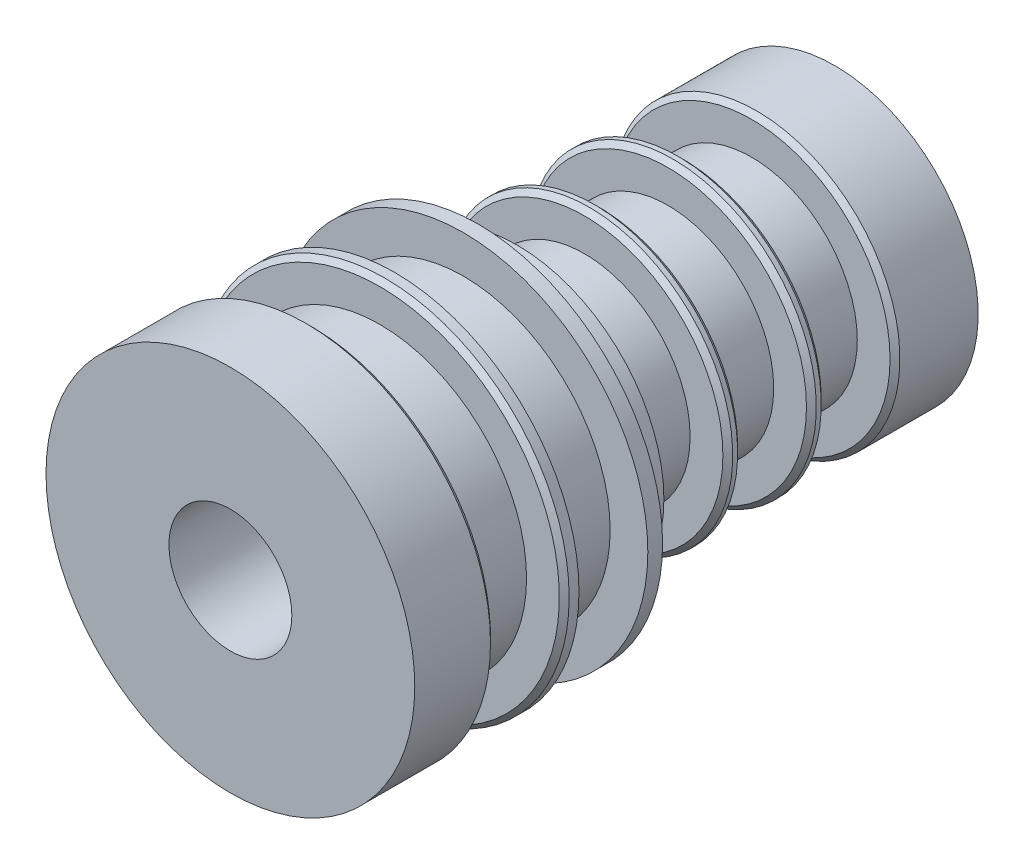
ISO-10303-21;
HEADER;
FILE_DESCRIPTION(('STEP AP214'),'2;1');
FILE_NAME('part.step','',(''),(''),'','','');
FILE_SCHEMA(('AUTOMOTIVE_DESIGN { 1 0 10303 214 1 1 1 1 }'));
ENDSEC;
DATA;
#1=APPLICATION_CONTEXT('core data for automotive mechanical design processes');
#2=APPLICATION_PROTOCOL_DEFINITION('international standard','automotive_design',2000,#1);
#3=PRODUCT_CONTEXT('',#1,'mechanical');
#4=PRODUCT('Part','Part','',(#3));
#5=PRODUCT_RELATED_PRODUCT_CATEGORY('part','',(#4));
#6=PRODUCT_DEFINITION_FORMATION('','',#4);
#7=PRODUCT_DEFINITION_CONTEXT('part definition',#1,'design');
#8=PRODUCT_DEFINITION('design','',#6,#7);
#9=PRODUCT_DEFINITION_SHAPE('','',#8);
#10=(LENGTH_UNIT() NAMED_UNIT(*) SI_UNIT(.MILLI.,.METRE.));
#11=(NAMED_UNIT(*) PLANE_ANGLE_UNIT() SI_UNIT($,.RADIAN.));
#12=(NAMED_UNIT(*) SI_UNIT($,.STERADIAN.) SOLID_ANGLE_UNIT());
#13=UNCERTAINTY_MEASURE_WITH_UNIT(LENGTH_MEASURE(1.E-05),#10,'distance_accuracy_value','');
#14=(GEOMETRIC_REPRESENTATION_CONTEXT(3) GLOBAL_UNCERTAINTY_ASSIGNED_CONTEXT((#13)) GLOBAL_UNIT_ASSIGNED_CONTEXT((#10,
#11,#12)) REPRESENTATION_CONTEXT('',''));
#15=CARTESIAN_POINT('',(0.,0.,0.));
#16=DIRECTION('',(0.,0.,1.));
#17=DIRECTION('',(1.,0.,0.));
#18=AXIS2_PLACEMENT_3D('',#15,#16,#17);
#19=CARTESIAN_POINT('',(0.,0.,-0.396875000000001));
#20=DIRECTION('',(0.,0.,1.));
#21=DIRECTION('',(1.,0.,0.));
#22=AXIS2_PLACEMENT_3D('',#19,#20,#21);
#23=CYLINDRICAL_SURFACE('',#22,14.2875);
#24=CARTESIAN_POINT('',(0.,0.,9.864725));
#25=DIRECTION('',(0.,0.,-1.));
#26=DIRECTION('',(-1.,0.,0.));
#27=AXIS2_PLACEMENT_3D('',#24,#25,#26);
#28=CIRCLE('',#27,14.2875);
#29=CARTESIAN_POINT('',(-14.2875,0.,9.864725));
#30=VERTEX_POINT('',#29);
#31=EDGE_CURVE('E62',#30,#30,#28,.T.);
#32=ORIENTED_EDGE('',*,*,#31,.T.);
#33=EDGE_LOOP('',(#32));
#34=FACE_BOUND('',#33,.T.);
#35=CARTESIAN_POINT('',(0.,0.,9.102725));
#36=DIRECTION('',(0.,0.,-1.));
#37=DIRECTION('',(-1.,0.,0.));
#38=AXIS2_PLACEMENT_3D('',#35,#36,#37);
#39=CIRCLE('',#38,14.2875);
#40=CARTESIAN_POINT('',(-14.2875,0.,9.102725));
#41=VERTEX_POINT('',#40);
#42=EDGE_CURVE('E135',#41,#41,#39,.T.);
#43=ORIENTED_EDGE('',*,*,#42,.F.);
#44=EDGE_LOOP('',(#43));
#45=FACE_BOUND('',#44,.T.);
#46=ADVANCED_FACE('F33',(#34,#45),#23,.T.);
#47=CARTESIAN_POINT('',(0.,0.,-0.396875000000001));
#48=DIRECTION('',(0.,0.,1.));
#49=DIRECTION('',(1.,0.,0.));
#50=AXIS2_PLACEMENT_3D('',#47,#48,#49);
#51=PLANE('',#50);
#52=CARTESIAN_POINT('',(0.,0.,-0.396875000000001));
#53=DIRECTION('',(0.,0.,1.));
#54=DIRECTION('',(1.,0.,0.));
#55=AXIS2_PLACEMENT_3D('',#52,#53,#54);
#56=CIRCLE('',#55,11.1125);
#57=CARTESIAN_POINT('',(11.1125,0.,-0.396875000000001));
#58=VERTEX_POINT('',#57);
#59=EDGE_CURVE('E105',#58,#58,#56,.T.);
#60=ORIENTED_EDGE('',*,*,#59,.T.);
#61=EDGE_LOOP('',(#60));
#62=FACE_BOUND('',#61,.T.);
#63=CARTESIAN_POINT('',(0.,0.,-0.396875000000001));
#64=DIRECTION('',(0.,0.,1.));
#65=DIRECTION('',(1.,0.,0.));
#66=AXIS2_PLACEMENT_3D('',#63,#64,#65);
#67=CIRCLE('',#66,11.3665);
#68=CARTESIAN_POINT('',(11.3665,0.,-0.396875000000001));
#69=VERTEX_POINT('',#68);
#70=EDGE_CURVE('E37',#69,#69,#67,.T.);
#71=ORIENTED_EDGE('',*,*,#70,.F.);
#72=EDGE_LOOP('',(#71));
#73=FACE_BOUND('',#72,.T.);
#74=ADVANCED_FACE('F156',(#62,#73),#51,.F.);
#75=CARTESIAN_POINT('',(0.,0.,15.960725));
#76=DIRECTION('',(0.,0.,-1.));
#77=DIRECTION('',(-1.,0.,0.));
#78=AXIS2_PLACEMENT_3D('',#75,#76,#77);
#79=CIRCLE('',#78,14.2875);
#80=CARTESIAN_POINT('',(-14.2875,0.,15.960725));
#81=VERTEX_POINT('',#80);
#82=EDGE_CURVE('E65',#81,#81,#79,.F.);
#83=ORIENTED_EDGE('',*,*,#82,.T.);
#84=EDGE_LOOP('',(#83));
#85=FACE_BOUND('',#84,.T.);
#86=CARTESIAN_POINT('',(0.,0.,21.828125));
#87=DIRECTION('',(0.,0.,1.));
#88=DIRECTION('',(1.,0.,0.));
#89=AXIS2_PLACEMENT_3D('',#86,#87,#88);
#90=CIRCLE('',#89,14.2875);
#91=CARTESIAN_POINT('',(14.2875,0.,21.828125));
#92=VERTEX_POINT('',#91);
#93=EDGE_CURVE('E86',#92,#92,#90,.T.);
#94=ORIENTED_EDGE('',*,*,#93,.F.);
#95=EDGE_LOOP('',(#94));
#96=FACE_BOUND('',#95,.T.);
#97=ADVANCED_FACE('F159',(#85,#96),#23,.T.);
#98=CARTESIAN_POINT('',(0.,0.,25.003125));
#99=DIRECTION('',(0.,0.,-1.));
#100=DIRECTION('',(-1.,0.,0.));
#101=AXIS2_PLACEMENT_3D('',#98,#99,#100);
#102=CYLINDRICAL_SURFACE('',#101,11.1125);
#103=CARTESIAN_POINT('',(0.,0.,-12.461875));
#104=DIRECTION('',(0.,0.,-1.));
#105=DIRECTION('',(-1.,0.,0.));
#106=AXIS2_PLACEMENT_3D('',#103,#104,#105);
#107=CIRCLE('',#106,11.1125);
#108=CARTESIAN_POINT('',(-11.1125,0.,-12.461875));
#109=VERTEX_POINT('',#108);
#110=EDGE_CURVE('E56',#109,#109,#107,.T.);
#111=CARTESIAN_POINT('',(0.,0.,-12.842875));
#112=DIRECTION('',(0.,0.,-1.));
#113=DIRECTION('',(-1.,0.,0.));
#114=AXIS2_PLACEMENT_3D('',#111,#112,#113);
#115=CIRCLE('',#114,11.1125);
#116=CARTESIAN_POINT('',(-11.1125,0.,-12.842875));
#117=VERTEX_POINT('',#116);
#118=EDGE_CURVE('E71',#117,#117,#115,.F.);
#119=CARTESIAN_POINT('',(-11.1125,0.,-12.461875));
#120=CARTESIAN_POINT('',(-11.1125,0.,-12.46584375));
#121=CARTESIAN_POINT('',(-11.1125,0.,-12.4698125));
#122=CARTESIAN_POINT('',(-11.1125,0.,-12.47775));
#123=CARTESIAN_POINT('',(-11.1125,0.,-12.48171875));
#124=CARTESIAN_POINT('',(-11.1125,0.,-12.48965625));
#125=CARTESIAN_POINT('',(-11.1125,0.,-12.493625));
#126=CARTESIAN_POINT('',(-11.1125,0.,-12.5015625));
#127=CARTESIAN_POINT('',(-11.1125,0.,-12.50553125));
#128=CARTESIAN_POINT('',(-11.1125,0.,-12.51346875));
#129=CARTESIAN_POINT('',(-11.1125,0.,-12.5174375));
#130=CARTESIAN_POINT('',(-11.1125,0.,-12.525375));
#131=CARTESIAN_POINT('',(-11.1125,0.,-12.52934375));
#132=CARTESIAN_POINT('',(-11.1125,0.,-12.53728125));
#133=CARTESIAN_POINT('',(-11.1125,0.,-12.54125));
#134=CARTESIAN_POINT('',(-11.1125,0.,-12.5491875));
#135=CARTESIAN_POINT('',(-11.1125,0.,-12.55315625));
#136=CARTESIAN_POINT('',(-11.1125,0.,-12.56109375));
#137=CARTESIAN_POINT('',(-11.1125,0.,-12.5650625));
#138=CARTESIAN_POINT('',(-11.1125,0.,-12.573));
#139=CARTESIAN_POINT('',(-11.1125,0.,-12.57696875));
#140=CARTESIAN_POINT('',(-11.1125,0.,-12.58490625));
#141=CARTESIAN_POINT('',(-11.1125,0.,-12.588875));
#142=CARTESIAN_POINT('',(-11.1125,0.,-12.5968125));
#143=CARTESIAN_POINT('',(-11.1125,0.,-12.60078125));
#144=CARTESIAN_POINT('',(-11.1125,0.,-12.60871875));
#145=CARTESIAN_POINT('',(-11.1125,0.,-12.6126875));
#146=CARTESIAN_POINT('',(-11.1125,0.,-12.620625));
#147=CARTESIAN_POINT('',(-11.1125,0.,-12.62459375));
#148=CARTESIAN_POINT('',(-11.1125,0.,-12.63253125));
#149=CARTESIAN_POINT('',(-11.1125,0.,-12.6365));
#150=CARTESIAN_POINT('',(-11.1125,0.,-12.6444375));
#151=CARTESIAN_POINT('',(-11.1125,0.,-12.64840625));
#152=CARTESIAN_POINT('',(-11.1125,0.,-12.65634375));
#153=CARTESIAN_POINT('',(-11.1125,0.,-12.6603125));
#154=CARTESIAN_POINT('',(-11.1125,0.,-12.66825));
#155=CARTESIAN_POINT('',(-11.1125,0.,-12.67221875));
#156=CARTESIAN_POINT('',(-11.1125,0.,-12.68015625));
#157=CARTESIAN_POINT('',(-11.1125,0.,-12.684125));
#158=CARTESIAN_POINT('',(-11.1125,0.,-12.6920625));
#159=CARTESIAN_POINT('',(-11.1125,0.,-12.69603125));
#160=CARTESIAN_POINT('',(-11.1125,0.,-12.70396875));
#161=CARTESIAN_POINT('',(-11.1125,0.,-12.7079375));
#162=CARTESIAN_POINT('',(-11.1125,0.,-12.715875));
#163=CARTESIAN_POINT('',(-11.1125,0.,-12.71984375));
#164=CARTESIAN_POINT('',(-11.1125,0.,-12.72778125));
#165=CARTESIAN_POINT('',(-11.1125,0.,-12.73175));
#166=CARTESIAN_POINT('',(-11.1125,0.,-12.7396875));
#167=CARTESIAN_POINT('',(-11.1125,0.,-12.74365625));
#168=CARTESIAN_POINT('',(-11.1125,0.,-12.75159375));
#169=CARTESIAN_POINT('',(-11.1125,0.,-12.7555625));
#170=CARTESIAN_POINT('',(-11.1125,0.,-12.7635));
#171=CARTESIAN_POINT('',(-11.1125,0.,-12.76746875));
#172=CARTESIAN_POINT('',(-11.1125,0.,-12.77540625));
#173=CARTESIAN_POINT('',(-11.1125,0.,-12.779375));
#174=CARTESIAN_POINT('',(-11.1125,0.,-12.7873125));
#175=CARTESIAN_POINT('',(-11.1125,0.,-12.79128125));
#176=CARTESIAN_POINT('',(-11.1125,0.,-12.79921875));
#177=CARTESIAN_POINT('',(-11.1125,0.,-12.8031875));
#178=CARTESIAN_POINT('',(-11.1125,0.,-12.811125));
#179=CARTESIAN_POINT('',(-11.1125,0.,-12.81509375));
#180=CARTESIAN_POINT('',(-11.1125,0.,-12.82303125));
#181=CARTESIAN_POINT('',(-11.1125,0.,-12.827));
#182=CARTESIAN_POINT('',(-11.1125,0.,-12.8349375));
#183=CARTESIAN_POINT('',(-11.1125,0.,-12.83890625));
#184=CARTESIAN_POINT('',(-11.1125,0.,-12.842875));
#185=B_SPLINE_CURVE_WITH_KNOTS('',3,(#119,#120,#121,#122,#123,#124,#125,#126,#127,#128,#129,
#130,#131,#132,#133,#134,#135,#136,#137,#138,#139,#140,#141,#142,#143,#144,#145,#146,#147,#148,
#149,#150,#151,#152,#153,#154,#155,#156,#157,#158,#159,#160,#161,#162,#163,#164,#165,#166,#167,
#168,#169,#170,#171,#172,#173,#174,#175,#176,#177,#178,#179,#180,#181,#182,#183,#184),
.UNSPECIFIED.,.F.,.F.,(4,2,2,2,2,2,2,2,2,2,2,2,2,2,2,2,2,2,2,2,2,2,2,2,2,2,2,2,2,2,2,2,4),(0.,
0.0119062499999989,0.0238124999999978,0.0357187500000036,0.0476250000000025,0.0595312500000014,
0.0714375000000003,0.0833437499999992,0.0952500000000051,0.107156250000004,0.119062500000003,
0.130968750000002,0.142875000000001,0.15478125,0.166687500000005,0.178593750000004,
0.190500000000003,0.202406250000002,0.214312500000001,0.226218750000007,0.238125000000006,
0.250031250000005,0.261937500000003,0.273843750000002,0.285750000000001,0.297656250000007,
0.309562500000006,0.321468750000005,0.333375000000004,0.345281250000003,0.357187500000009,
0.369093750000007,0.381000000000006),.UNSPECIFIED.);
#186=EDGE_CURVE('BSEAM170',#109,#117,#185,.T.);
#187=ORIENTED_EDGE('',*,*,#110,.T.);
#188=ORIENTED_EDGE('',*,*,#118,.T.);
#189=ORIENTED_EDGE('',*,*,#186,.T.);
#190=ORIENTED_EDGE('',*,*,#186,.F.);
#191=EDGE_LOOP('',(#187,#189,#188,#190));
#192=FACE_BOUND('',#191,.T.);
#193=ADVANCED_FACE('F170',(#192),#102,.T.);
#194=CARTESIAN_POINT('',(0.,0.,-18.938875));
#195=DIRECTION('',(0.,0.,-1.));
#196=DIRECTION('',(-1.,0.,0.));
#197=AXIS2_PLACEMENT_3D('',#194,#195,#196);
#198=CIRCLE('',#197,11.1125);
#199=CARTESIAN_POINT('',(-11.1125,0.,-18.938875));
#200=VERTEX_POINT('',#199);
#201=EDGE_CURVE('E80',#200,#200,#198,.T.);
#202=CARTESIAN_POINT('',(0.,0.,-25.003125));
#203=DIRECTION('',(0.,0.,1.));
#204=DIRECTION('',(1.,0.,0.));
#205=AXIS2_PLACEMENT_3D('',#202,#203,#204);
#206=CIRCLE('',#205,11.1125);
#207=CARTESIAN_POINT('',(-11.1125,0.,-25.003125));
#208=VERTEX_POINT('',#207);
#209=EDGE_CURVE('E83',#208,#208,#206,.T.);
#210=CARTESIAN_POINT('',(-11.1125,0.,-18.938875));
#211=CARTESIAN_POINT('',(-11.1125,0.,-19.0020442708333));
#212=CARTESIAN_POINT('',(-11.1125,0.,-19.0652135416667));
#213=CARTESIAN_POINT('',(-11.1125,0.,-19.1915520833333));
#214=CARTESIAN_POINT('',(-11.1125,0.,-19.2547213541667));
#215=CARTESIAN_POINT('',(-11.1125,0.,-19.3810598958333));
#216=CARTESIAN_POINT('',(-11.1125,0.,-19.4442291666667));
#217=CARTESIAN_POINT('',(-11.1125,0.,-19.5705677083333));
#218=CARTESIAN_POINT('',(-11.1125,0.,-19.6337369791667));
#219=CARTESIAN_POINT('',(-11.1125,0.,-19.7600755208333));
#220=CARTESIAN_POINT('',(-11.1125,0.,-19.8232447916667));
#221=CARTESIAN_POINT('',(-11.1125,0.,-19.9495833333333));
#222=CARTESIAN_POINT('',(-11.1125,0.,-20.0127526041667));
#223=CARTESIAN_POINT('',(-11.1125,0.,-20.1390911458333));
#224=CARTESIAN_POINT('',(-11.1125,0.,-20.2022604166667));
#225=CARTESIAN_POINT('',(-11.1125,0.,-20.3285989583333));
#226=CARTESIAN_POINT('',(-11.1125,0.,-20.3917682291667));
#227=CARTESIAN_POINT('',(-11.1125,0.,-20.5181067708333));
#228=CARTESIAN_POINT('',(-11.1125,0.,-20.5812760416667));
#229=CARTESIAN_POINT('',(-11.1125,0.,-20.7076145833333));
#230=CARTESIAN_POINT('',(-11.1125,0.,-20.7707838541667));
#231=CARTESIAN_POINT('',(-11.1125,0.,-20.8971223958333));
#232=CARTESIAN_POINT('',(-11.1125,0.,-20.9602916666667));
#233=CARTESIAN_POINT('',(-11.1125,0.,-21.0866302083333));
#234=CARTESIAN_POINT('',(-11.1125,0.,-21.1497994791667));
#235=CARTESIAN_POINT('',(-11.1125,0.,-21.2761380208333));
#236=CARTESIAN_POINT('',(-11.1125,0.,-21.3393072916667));
#237=CARTESIAN_POINT('',(-11.1125,0.,-21.4656458333333));
#238=CARTESIAN_POINT('',(-11.1125,0.,-21.5288151041667));
#239=CARTESIAN_POINT('',(-11.1125,0.,-21.6551536458333));
#240=CARTESIAN_POINT('',(-11.1125,0.,-21.7183229166667));
#241=CARTESIAN_POINT('',(-11.1125,0.,-21.8446614583333));
#242=CARTESIAN_POINT('',(-11.1125,0.,-21.9078307291667));
#243=CARTESIAN_POINT('',(-11.1125,0.,-22.0341692708333));
#244=CARTESIAN_POINT('',(-11.1125,0.,-22.0973385416667));
#245=CARTESIAN_POINT('',(-11.1125,0.,-22.2236770833333));
#246=CARTESIAN_POINT('',(-11.1125,0.,-22.2868463541667));
#247=CARTESIAN_POINT('',(-11.1125,0.,-22.4131848958333));
#248=CARTESIAN_POINT('',(-11.1125,0.,-22.4763541666667));
#249=CARTESIAN_POINT('',(-11.1125,0.,-22.6026927083333));
#250=CARTESIAN_POINT('',(-11.1125,0.,-22.6658619791667));
#251=CARTESIAN_POINT('',(-11.1125,0.,-22.7922005208333));
#252=CARTESIAN_POINT('',(-11.1125,0.,-22.8553697916667));
#253=CARTESIAN_POINT('',(-11.1125,0.,-22.9817083333333));
#254=CARTESIAN_POINT('',(-11.1125,0.,-23.0448776041667));
#255=CARTESIAN_POINT('',(-11.1125,0.,-23.1712161458333));
#256=CARTESIAN_POINT('',(-11.1125,0.,-23.2343854166667));
#257=CARTESIAN_POINT('',(-11.1125,0.,-23.3607239583333));
#258=CARTESIAN_POINT('',(-11.1125,0.,-23.4238932291667));
#259=CARTESIAN_POINT('',(-11.1125,0.,-23.5502317708333));
#260=CARTESIAN_POINT('',(-11.1125,0.,-23.6134010416667));
#261=CARTESIAN_POINT('',(-11.1125,0.,-23.7397395833333));
#262=CARTESIAN_POINT('',(-11.1125,0.,-23.8029088541667));
#263=CARTESIAN_POINT('',(-11.1125,0.,-23.9292473958333));
#264=CARTESIAN_POINT('',(-11.1125,0.,-23.9924166666667));
#265=CARTESIAN_POINT('',(-11.1125,0.,-24.1187552083333));
#266=CARTESIAN_POINT('',(-11.1125,0.,-24.1819244791667));
#267=CARTESIAN_POINT('',(-11.1125,0.,-24.3082630208333));
#268=CARTESIAN_POINT('',(-11.1125,0.,-24.3714322916667));
#269=CARTESIAN_POINT('',(-11.1125,0.,-24.4977708333333));
#270=CARTESIAN_POINT('',(-11.1125,0.,-24.5609401041667));
#271=CARTESIAN_POINT('',(-11.1125,0.,-24.6872786458333));
#272=CARTESIAN_POINT('',(-11.1125,0.,-24.7504479166667));
#273=CARTESIAN_POINT('',(-11.1125,0.,-24.8767864583333));
#274=CARTESIAN_POINT('',(-11.1125,0.,-24.9399557291667));
#275=CARTESIAN_POINT('',(-11.1125,0.,-25.003125));
#276=B_SPLINE_CURVE_WITH_KNOTS('',3,(#210,#211,#212,#213,#214,#215,#216,#217,#218,#219,#220,
#221,#222,#223,#224,#225,#226,#227,#228,#229,#230,#231,#232,#233,#234,#235,#236,#237,#238,#239,
#240,#241,#242,#243,#244,#245,#246,#247,#248,#249,#250,#251,#252,#253,#254,#255,#256,#257,#258,
#259,#260,#261,#262,#263,#264,#265,#266,#267,#268,#269,#270,#271,#272,#273,#274,#275),
.UNSPECIFIED.,.F.,.F.,(4,2,2,2,2,2,2,2,2,2,2,2,2,2,2,2,2,2,2,2,2,2,2,2,2,2,2,2,2,2,2,2,4),(0.,
0.189507812500003,0.379015625,0.568523437499996,0.758031249999999,0.947539062500002,1.137046875,
1.32655468749999,1.5160625,1.7055703125,1.895078125,2.08458593749999,2.27409375,2.4636015625,
2.653109375,2.84261718749999,3.032125,3.2216328125,3.411140625,3.60064843749999,3.79015625,
3.9796640625,4.169171875,4.35867968749999,4.54818749999999,4.7376953125,4.92720312499999,
5.11671093749999,5.30621874999999,5.4957265625,5.68523437499999,5.87474218749999,
6.06424999999999),.UNSPECIFIED.);
#277=EDGE_CURVE('BSEAM175',#200,#208,#276,.T.);
#278=ORIENTED_EDGE('',*,*,#201,.T.);
#279=ORIENTED_EDGE('',*,*,#209,.T.);
#280=ORIENTED_EDGE('',*,*,#277,.T.);
#281=ORIENTED_EDGE('',*,*,#277,.F.);
#282=EDGE_LOOP('',(#278,#280,#279,#281));
#283=FACE_BOUND('',#282,.T.);
#284=ADVANCED_FACE('F175',(#283),#102,.T.);
#285=CARTESIAN_POINT('',(0.,0.,-25.003125));
#286=DIRECTION('',(0.,0.,1.));
#287=DIRECTION('',(1.,0.,0.));
#288=AXIS2_PLACEMENT_3D('',#285,#286,#287);
#289=PLANE('',#288);
#290=CARTESIAN_POINT('',(0.,0.,-25.003125));
#291=DIRECTION('',(0.,0.,1.));
#292=DIRECTION('',(1.,0.,0.));
#293=AXIS2_PLACEMENT_3D('',#290,#291,#292);
#294=CIRCLE('',#293,4.7625);
#295=CARTESIAN_POINT('',(4.7625,0.,-25.003125));
#296=VERTEX_POINT('',#295);
#297=EDGE_CURVE('E89',#296,#296,#294,.T.);
#298=ORIENTED_EDGE('',*,*,#297,.T.);
#299=EDGE_LOOP('',(#298));
#300=FACE_BOUND('',#299,.T.);
#301=ORIENTED_EDGE('',*,*,#209,.F.);
#302=EDGE_LOOP('',(#301));
#303=FACE_BOUND('',#302,.T.);
#304=ADVANCED_FACE('F186',(#300,#303),#289,.F.);
#305=CARTESIAN_POINT('',(0.,0.,21.828125));
#306=DIRECTION('',(0.,0.,1.));
#307=DIRECTION('',(1.,0.,0.));
#308=AXIS2_PLACEMENT_3D('',#305,#306,#307);
#309=PLANE('',#308);
#310=CARTESIAN_POINT('',(0.,0.,21.828125));
#311=DIRECTION('',(0.,0.,1.));
#312=DIRECTION('',(1.,0.,0.));
#313=AXIS2_PLACEMENT_3D('',#310,#311,#312);
#314=CIRCLE('',#313,4.7625);
#315=CARTESIAN_POINT('',(4.7625,0.,21.828125));
#316=VERTEX_POINT('',#315);
#317=EDGE_CURVE('E90',#316,#316,#314,.T.);
#318=ORIENTED_EDGE('',*,*,#317,.F.);
#319=EDGE_LOOP('',(#318));
#320=FACE_BOUND('',#319,.T.);
#321=ORIENTED_EDGE('',*,*,#93,.T.);
#322=EDGE_LOOP('',(#321));
#323=FACE_BOUND('',#322,.T.);
#324=ADVANCED_FACE('F183',(#320,#323),#309,.T.);
#325=CARTESIAN_POINT('',(0.,0.,-25.003125));
#326=DIRECTION('',(0.,0.,1.));
#327=DIRECTION('',(1.,0.,0.));
#328=AXIS2_PLACEMENT_3D('',#325,#326,#327);
#329=CYLINDRICAL_SURFACE('',#328,4.7625);
#330=ORIENTED_EDGE('',*,*,#297,.F.);
#331=EDGE_LOOP('',(#330));
#332=FACE_BOUND('',#331,.T.);
#333=ORIENTED_EDGE('',*,*,#317,.T.);
#334=EDGE_LOOP('',(#333));
#335=FACE_BOUND('',#334,.T.);
#336=ADVANCED_FACE('F185',(#332,#335),#329,.F.);
#337=CARTESIAN_POINT('',(0.,0.,-13.223875));
#338=DIRECTION('',(0.,0.,-1.));
#339=DIRECTION('',(-1.,0.,0.));
#340=AXIS2_PLACEMENT_3D('',#337,#338,#339);
#341=PLANE('',#340);
#342=CARTESIAN_POINT('',(0.,0.,-13.223875));
#343=DIRECTION('',(0.,0.,-1.));
#344=DIRECTION('',(-1.,0.,0.));
#345=AXIS2_PLACEMENT_3D('',#342,#343,#344);
#346=CIRCLE('',#345,10.7315);
#347=CARTESIAN_POINT('',(-10.7315,0.,-13.223875));
#348=VERTEX_POINT('',#347);
#349=EDGE_CURVE('E74',#348,#348,#346,.T.);
#350=ORIENTED_EDGE('',*,*,#349,.T.);
#351=EDGE_LOOP('',(#350));
#352=FACE_BOUND('',#351,.T.);
#353=CARTESIAN_POINT('',(0.,0.,-13.223875));
#354=DIRECTION('',(0.,0.,-1.));
#355=DIRECTION('',(-1.,0.,0.));
#356=AXIS2_PLACEMENT_3D('',#353,#354,#355);
#357=CIRCLE('',#356,8.1915);
#358=CARTESIAN_POINT('',(-8.1915,0.,-13.223875));
#359=VERTEX_POINT('',#358);
#360=EDGE_CURVE('E93',#359,#359,#357,.T.);
#361=ORIENTED_EDGE('',*,*,#360,.F.);
#362=EDGE_LOOP('',(#361));
#363=FACE_BOUND('',#362,.T.);
#364=ADVANCED_FACE('F193',(#352,#363),#341,.T.);
#365=CARTESIAN_POINT('',(0.,0.,-18.557875));
#366=DIRECTION('',(0.,0.,-1.));
#367=DIRECTION('',(-1.,0.,0.));
#368=AXIS2_PLACEMENT_3D('',#365,#366,#367);
#369=PLANE('',#368);
#370=CARTESIAN_POINT('',(0.,0.,-18.557875));
#371=DIRECTION('',(0.,0.,-1.));
#372=DIRECTION('',(-1.,0.,0.));
#373=AXIS2_PLACEMENT_3D('',#370,#371,#372);
#374=CIRCLE('',#373,10.7315);
#375=CARTESIAN_POINT('',(-10.7315,0.,-18.557875));
#376=VERTEX_POINT('',#375);
#377=EDGE_CURVE('E77',#376,#376,#374,.F.);
#378=ORIENTED_EDGE('',*,*,#377,.T.);
#379=EDGE_LOOP('',(#378));
#380=FACE_BOUND('',#379,.T.);
#381=CARTESIAN_POINT('',(0.,0.,-18.557875));
#382=DIRECTION('',(0.,0.,-1.));
#383=DIRECTION('',(-1.,0.,0.));
#384=AXIS2_PLACEMENT_3D('',#381,#382,#383);
#385=CIRCLE('',#384,8.1915);
#386=CARTESIAN_POINT('',(-8.1915,0.,-18.557875));
#387=VERTEX_POINT('',#386);
#388=EDGE_CURVE('E96',#387,#387,#385,.T.);
#389=ORIENTED_EDGE('',*,*,#388,.T.);
#390=EDGE_LOOP('',(#389));
#391=FACE_BOUND('',#390,.T.);
#392=ADVANCED_FACE('F199',(#380,#391),#369,.F.);
#393=CARTESIAN_POINT('',(0.,0.,-13.223875));
#394=DIRECTION('',(0.,0.,-1.));
#395=DIRECTION('',(-1.,0.,0.));
#396=AXIS2_PLACEMENT_3D('',#393,#394,#395);
#397=CYLINDRICAL_SURFACE('',#396,8.1915);
#398=ORIENTED_EDGE('',*,*,#360,.T.);
#399=EDGE_LOOP('',(#398));
#400=FACE_BOUND('',#399,.T.);
#401=ORIENTED_EDGE('',*,*,#388,.F.);
#402=EDGE_LOOP('',(#401));
#403=FACE_BOUND('',#402,.T.);
#404=ADVANCED_FACE('F202',(#400,#403),#397,.T.);
#405=CARTESIAN_POINT('',(0.,0.,-18.938875));
#406=DIRECTION('',(0.,0.,-1.));
#407=DIRECTION('',(-1.,0.,0.));
#408=AXIS2_PLACEMENT_3D('',#405,#406,#407);
#409=CONICAL_SURFACE('',#408,11.1125,0.785398163397453);
#410=ORIENTED_EDGE('',*,*,#377,.F.);
#411=EDGE_LOOP('',(#410));
#412=FACE_BOUND('',#411,.T.);
#413=ORIENTED_EDGE('',*,*,#201,.F.);
#414=EDGE_LOOP('',(#413));
#415=FACE_BOUND('',#414,.T.);
#416=ADVANCED_FACE('F209',(#412,#415),#409,.T.);
#417=CARTESIAN_POINT('',(0.,0.,-13.223875));
#418=DIRECTION('',(0.,0.,1.));
#419=DIRECTION('',(1.,0.,0.));
#420=AXIS2_PLACEMENT_3D('',#417,#418,#419);
#421=CONICAL_SURFACE('',#420,10.7315,0.785398163397453);
#422=ORIENTED_EDGE('',*,*,#118,.F.);
#423=EDGE_LOOP('',(#422));
#424=FACE_BOUND('',#423,.T.);
#425=ORIENTED_EDGE('',*,*,#349,.F.);
#426=EDGE_LOOP('',(#425));
#427=FACE_BOUND('',#426,.T.);
#428=ADVANCED_FACE('F219',(#424,#427),#421,.T.);
#429=CARTESIAN_POINT('',(0.,0.,15.579725));
#430=DIRECTION('',(0.,0.,-1.));
#431=DIRECTION('',(-1.,0.,0.));
#432=AXIS2_PLACEMENT_3D('',#429,#430,#431);
#433=PLANE('',#432);
#434=CARTESIAN_POINT('',(0.,0.,15.579725));
#435=DIRECTION('',(0.,0.,-1.));
#436=DIRECTION('',(-1.,0.,0.));
#437=AXIS2_PLACEMENT_3D('',#434,#435,#436);
#438=CIRCLE('',#437,13.9065);
#439=CARTESIAN_POINT('',(-13.9065,0.,15.579725));
#440=VERTEX_POINT('',#439);
#441=EDGE_CURVE('E68',#440,#440,#438,.T.);
#442=ORIENTED_EDGE('',*,*,#441,.T.);
#443=EDGE_LOOP('',(#442));
#444=FACE_BOUND('',#443,.T.);
#445=CARTESIAN_POINT('',(0.,0.,15.579725));
#446=DIRECTION('',(0.,0.,-1.));
#447=DIRECTION('',(-1.,0.,0.));
#448=AXIS2_PLACEMENT_3D('',#445,#446,#447);
#449=CIRCLE('',#448,11.3665);
#450=CARTESIAN_POINT('',(-11.3665,0.,15.579725));
#451=VERTEX_POINT('',#450);
#452=EDGE_CURVE('E99',#451,#451,#449,.T.);
#453=ORIENTED_EDGE('',*,*,#452,.F.);
#454=EDGE_LOOP('',(#453));
#455=FACE_BOUND('',#454,.T.);
#456=ADVANCED_FACE('F215',(#444,#455),#433,.T.);
#457=CARTESIAN_POINT('',(0.,0.,10.245725));
#458=DIRECTION('',(0.,0.,-1.));
#459=DIRECTION('',(-1.,0.,0.));
#460=AXIS2_PLACEMENT_3D('',#457,#458,#459);
#461=PLANE('',#460);
#462=CARTESIAN_POINT('',(0.,0.,10.245725));
#463=DIRECTION('',(0.,0.,-1.));
#464=DIRECTION('',(-1.,0.,0.));
#465=AXIS2_PLACEMENT_3D('',#462,#463,#464);
#466=CIRCLE('',#465,13.9065);
#467=CARTESIAN_POINT('',(-13.9065,0.,10.245725));
#468=VERTEX_POINT('',#467);
#469=EDGE_CURVE('E59',#468,#468,#466,.F.);
#470=ORIENTED_EDGE('',*,*,#469,.T.);
#471=EDGE_LOOP('',(#470));
#472=FACE_BOUND('',#471,.T.);
#473=CARTESIAN_POINT('',(0.,0.,10.245725));
#474=DIRECTION('',(0.,0.,-1.));
#475=DIRECTION('',(-1.,0.,0.));
#476=AXIS2_PLACEMENT_3D('',#473,#474,#475);
#477=CIRCLE('',#476,11.3665);
#478=CARTESIAN_POINT('',(-11.3665,0.,10.245725));
#479=VERTEX_POINT('',#478);
#480=EDGE_CURVE('E102',#479,#479,#477,.T.);
#481=ORIENTED_EDGE('',*,*,#480,.T.);
#482=EDGE_LOOP('',(#481));
#483=FACE_BOUND('',#482,.T.);
#484=ADVANCED_FACE('F211',(#472,#483),#461,.F.);
#485=CARTESIAN_POINT('',(0.,0.,15.579725));
#486=DIRECTION('',(0.,0.,-1.));
#487=DIRECTION('',(-1.,0.,0.));
#488=AXIS2_PLACEMENT_3D('',#485,#486,#487);
#489=CYLINDRICAL_SURFACE('',#488,11.3665);
#490=ORIENTED_EDGE('',*,*,#452,.T.);
#491=EDGE_LOOP('',(#490));
#492=FACE_BOUND('',#491,.T.);
#493=ORIENTED_EDGE('',*,*,#480,.F.);
#494=EDGE_LOOP('',(#493));
#495=FACE_BOUND('',#494,.T.);
#496=ADVANCED_FACE('F214',(#492,#495),#489,.T.);
#497=CARTESIAN_POINT('',(0.,0.,15.579725));
#498=DIRECTION('',(0.,0.,1.));
#499=DIRECTION('',(1.,0.,0.));
#500=AXIS2_PLACEMENT_3D('',#497,#498,#499);
#501=CONICAL_SURFACE('',#500,13.9065,0.785398163397444);
#502=ORIENTED_EDGE('',*,*,#82,.F.);
#503=EDGE_LOOP('',(#502));
#504=FACE_BOUND('',#503,.T.);
#505=ORIENTED_EDGE('',*,*,#441,.F.);
#506=EDGE_LOOP('',(#505));
#507=FACE_BOUND('',#506,.T.);
#508=ADVANCED_FACE('F223',(#504,#507),#501,.T.);
#509=CARTESIAN_POINT('',(0.,0.,9.864725));
#510=DIRECTION('',(0.,0.,-1.));
#511=DIRECTION('',(-1.,0.,0.));
#512=AXIS2_PLACEMENT_3D('',#509,#510,#511);
#513=CONICAL_SURFACE('',#512,14.2875,0.785398163397448);
#514=ORIENTED_EDGE('',*,*,#469,.F.);
#515=EDGE_LOOP('',(#514));
#516=FACE_BOUND('',#515,.T.);
#517=ORIENTED_EDGE('',*,*,#31,.F.);
#518=EDGE_LOOP('',(#517));
#519=FACE_BOUND('',#518,.T.);
#520=ADVANCED_FACE('F229',(#516,#519),#513,.T.);
#521=CARTESIAN_POINT('',(0.,0.,-0.269874999999998));
#522=DIRECTION('',(0.,0.,-1.));
#523=DIRECTION('',(-1.,0.,0.));
#524=AXIS2_PLACEMENT_3D('',#521,#522,#523);
#525=CYLINDRICAL_SURFACE('',#524,11.1125);
#526=CARTESIAN_POINT('',(0.,0.,-0.269874999999998));
#527=DIRECTION('',(0.,0.,-1.));
#528=DIRECTION('',(-1.,0.,0.));
#529=AXIS2_PLACEMENT_3D('',#526,#527,#528);
#530=CIRCLE('',#529,11.1125);
#531=CARTESIAN_POINT('',(-11.1125,0.,-0.269874999999998));
#532=VERTEX_POINT('',#531);
#533=EDGE_CURVE('E111',#532,#532,#530,.T.);
#534=ORIENTED_EDGE('',*,*,#533,.F.);
#535=EDGE_LOOP('',(#534));
#536=FACE_BOUND('',#535,.T.);
#537=ORIENTED_EDGE('',*,*,#59,.F.);
#538=EDGE_LOOP('',(#537));
#539=FACE_BOUND('',#538,.T.);
#540=ADVANCED_FACE('F225',(#536,#539),#525,.F.);
#541=CARTESIAN_POINT('',(0.,0.,-0.269874999999998));
#542=DIRECTION('',(0.,0.,-1.));
#543=DIRECTION('',(-1.,0.,0.));
#544=AXIS2_PLACEMENT_3D('',#541,#542,#543);
#545=PLANE('',#544);
#546=CARTESIAN_POINT('',(0.,0.,-0.269874999999998));
#547=DIRECTION('',(0.,0.,-1.));
#548=DIRECTION('',(-1.,0.,0.));
#549=AXIS2_PLACEMENT_3D('',#546,#547,#548);
#550=CIRCLE('',#549,8.1915);
#551=CARTESIAN_POINT('',(-8.1915,0.,-0.269874999999998));
#552=VERTEX_POINT('',#551);
#553=EDGE_CURVE('E115',#552,#552,#550,.T.);
#554=ORIENTED_EDGE('',*,*,#553,.F.);
#555=EDGE_LOOP('',(#554));
#556=FACE_BOUND('',#555,.T.);
#557=ORIENTED_EDGE('',*,*,#533,.T.);
#558=EDGE_LOOP('',(#557));
#559=FACE_BOUND('',#558,.T.);
#560=ADVANCED_FACE('F228',(#556,#559),#545,.T.);
#561=CARTESIAN_POINT('',(0.,0.,-5.603875));
#562=DIRECTION('',(0.,0.,-1.));
#563=DIRECTION('',(-1.,0.,0.));
#564=AXIS2_PLACEMENT_3D('',#561,#562,#563);
#565=PLANE('',#564);
#566=CARTESIAN_POINT('',(0.,0.,-5.603875));
#567=DIRECTION('',(0.,0.,-1.));
#568=DIRECTION('',(-1.,0.,0.));
#569=AXIS2_PLACEMENT_3D('',#566,#567,#568);
#570=CIRCLE('',#569,10.7315);
#571=CARTESIAN_POINT('',(-10.7315,0.,-5.603875));
#572=VERTEX_POINT('',#571);
#573=EDGE_CURVE('E10',#572,#572,#570,.F.);
#574=ORIENTED_EDGE('',*,*,#573,.T.);
#575=EDGE_LOOP('',(#574));
#576=FACE_BOUND('',#575,.T.);
#577=CARTESIAN_POINT('',(0.,0.,-5.603875));
#578=DIRECTION('',(0.,0.,-1.));
#579=DIRECTION('',(-1.,0.,0.));
#580=AXIS2_PLACEMENT_3D('',#577,#578,#579);
#581=CIRCLE('',#580,8.1915);
#582=CARTESIAN_POINT('',(-8.1915,0.,-5.603875));
#583=VERTEX_POINT('',#582);
#584=EDGE_CURVE('E116',#583,#583,#581,.T.);
#585=ORIENTED_EDGE('',*,*,#584,.T.);
#586=EDGE_LOOP('',(#585));
#587=FACE_BOUND('',#586,.T.);
#588=ADVANCED_FACE('F231',(#576,#587),#565,.F.);
#589=CARTESIAN_POINT('',(0.,0.,-0.269874999999998));
#590=DIRECTION('',(0.,0.,-1.));
#591=DIRECTION('',(-1.,0.,0.));
#592=AXIS2_PLACEMENT_3D('',#589,#590,#591);
#593=CYLINDRICAL_SURFACE('',#592,8.1915);
#594=ORIENTED_EDGE('',*,*,#553,.T.);
#595=EDGE_LOOP('',(#594));
#596=FACE_BOUND('',#595,.T.);
#597=ORIENTED_EDGE('',*,*,#584,.F.);
#598=EDGE_LOOP('',(#597));
#599=FACE_BOUND('',#598,.T.);
#600=ADVANCED_FACE('F234',(#596,#599),#593,.T.);
#601=CARTESIAN_POINT('',(0.,0.,-5.98487500000001));
#602=DIRECTION('',(0.,0.,-1.));
#603=DIRECTION('',(-1.,0.,0.));
#604=AXIS2_PLACEMENT_3D('',#601,#602,#603);
#605=CIRCLE('',#604,11.1125);
#606=CARTESIAN_POINT('',(-11.1125,0.,-5.98487500000001));
#607=VERTEX_POINT('',#606);
#608=EDGE_CURVE('E41',#607,#607,#605,.T.);
#609=CARTESIAN_POINT('',(0.,0.,-6.36587500000001));
#610=DIRECTION('',(0.,0.,-1.));
#611=DIRECTION('',(-1.,0.,0.));
#612=AXIS2_PLACEMENT_3D('',#609,#610,#611);
#613=CIRCLE('',#612,11.1125);
#614=CARTESIAN_POINT('',(-11.1125,0.,-6.365875));
#615=VERTEX_POINT('',#614);
#616=EDGE_CURVE('E45',#615,#615,#613,.F.);
#617=CARTESIAN_POINT('',(-11.1125,0.,-5.98487500000001));
#618=CARTESIAN_POINT('',(-11.1125,0.,-5.98884375000001));
#619=CARTESIAN_POINT('',(-11.1125,0.,-5.99281250000001));
#620=CARTESIAN_POINT('',(-11.1125,0.,-6.00075000000001));
#621=CARTESIAN_POINT('',(-11.1125,0.,-6.00471875000001));
#622=CARTESIAN_POINT('',(-11.1125,0.,-6.01265625000001));
#623=CARTESIAN_POINT('',(-11.1125,0.,-6.01662500000001));
#624=CARTESIAN_POINT('',(-11.1125,0.,-6.02456250000001));
#625=CARTESIAN_POINT('',(-11.1125,0.,-6.02853125000001));
#626=CARTESIAN_POINT('',(-11.1125,0.,-6.03646875000001));
#627=CARTESIAN_POINT('',(-11.1125,0.,-6.04043750000001));
#628=CARTESIAN_POINT('',(-11.1125,0.,-6.04837500000001));
#629=CARTESIAN_POINT('',(-11.1125,0.,-6.05234375000001));
#630=CARTESIAN_POINT('',(-11.1125,0.,-6.06028125000001));
#631=CARTESIAN_POINT('',(-11.1125,0.,-6.06425000000001));
#632=CARTESIAN_POINT('',(-11.1125,0.,-6.07218750000001));
#633=CARTESIAN_POINT('',(-11.1125,0.,-6.07615625000001));
#634=CARTESIAN_POINT('',(-11.1125,0.,-6.08409375000001));
#635=CARTESIAN_POINT('',(-11.1125,0.,-6.08806250000001));
#636=CARTESIAN_POINT('',(-11.1125,0.,-6.09600000000001));
#637=CARTESIAN_POINT('',(-11.1125,0.,-6.09996875000001));
#638=CARTESIAN_POINT('',(-11.1125,0.,-6.10790625000001));
#639=CARTESIAN_POINT('',(-11.1125,0.,-6.11187500000001));
#640=CARTESIAN_POINT('',(-11.1125,0.,-6.11981250000001));
#641=CARTESIAN_POINT('',(-11.1125,0.,-6.12378125000001));
#642=CARTESIAN_POINT('',(-11.1125,0.,-6.13171875000001));
#643=CARTESIAN_POINT('',(-11.1125,0.,-6.13568750000001));
#644=CARTESIAN_POINT('',(-11.1125,0.,-6.14362500000001));
#645=CARTESIAN_POINT('',(-11.1125,0.,-6.14759375000001));
#646=CARTESIAN_POINT('',(-11.1125,0.,-6.15553125000001));
#647=CARTESIAN_POINT('',(-11.1125,0.,-6.15950000000001));
#648=CARTESIAN_POINT('',(-11.1125,0.,-6.16743750000001));
#649=CARTESIAN_POINT('',(-11.1125,0.,-6.17140625000001));
#650=CARTESIAN_POINT('',(-11.1125,0.,-6.17934375000001));
#651=CARTESIAN_POINT('',(-11.1125,0.,-6.18331250000001));
#652=CARTESIAN_POINT('',(-11.1125,0.,-6.19125000000001));
#653=CARTESIAN_POINT('',(-11.1125,0.,-6.19521875000001));
#654=CARTESIAN_POINT('',(-11.1125,0.,-6.20315625000001));
#655=CARTESIAN_POINT('',(-11.1125,0.,-6.20712500000001));
#656=CARTESIAN_POINT('',(-11.1125,0.,-6.21506250000001));
#657=CARTESIAN_POINT('',(-11.1125,0.,-6.21903125000001));
#658=CARTESIAN_POINT('',(-11.1125,0.,-6.22696875000001));
#659=CARTESIAN_POINT('',(-11.1125,0.,-6.23093750000001));
#660=CARTESIAN_POINT('',(-11.1125,0.,-6.23887500000001));
#661=CARTESIAN_POINT('',(-11.1125,0.,-6.24284375000001));
#662=CARTESIAN_POINT('',(-11.1125,0.,-6.25078125000001));
#663=CARTESIAN_POINT('',(-11.1125,0.,-6.25475000000001));
#664=CARTESIAN_POINT('',(-11.1125,0.,-6.26268750000001));
#665=CARTESIAN_POINT('',(-11.1125,0.,-6.26665625000001));
#666=CARTESIAN_POINT('',(-11.1125,0.,-6.27459375));
#667=CARTESIAN_POINT('',(-11.1125,0.,-6.2785625));
#668=CARTESIAN_POINT('',(-11.1125,0.,-6.2865));
#669=CARTESIAN_POINT('',(-11.1125,0.,-6.29046875));
#670=CARTESIAN_POINT('',(-11.1125,0.,-6.29840625));
#671=CARTESIAN_POINT('',(-11.1125,0.,-6.302375));
#672=CARTESIAN_POINT('',(-11.1125,0.,-6.3103125));
#673=CARTESIAN_POINT('',(-11.1125,0.,-6.31428125));
#674=CARTESIAN_POINT('',(-11.1125,0.,-6.32221875));
#675=CARTESIAN_POINT('',(-11.1125,0.,-6.3261875));
#676=CARTESIAN_POINT('',(-11.1125,0.,-6.33412500000001));
#677=CARTESIAN_POINT('',(-11.1125,0.,-6.33809375000001));
#678=CARTESIAN_POINT('',(-11.1125,0.,-6.34603125000001));
#679=CARTESIAN_POINT('',(-11.1125,0.,-6.35));
#680=CARTESIAN_POINT('',(-11.1125,0.,-6.3579375));
#681=CARTESIAN_POINT('',(-11.1125,0.,-6.36190625));
#682=CARTESIAN_POINT('',(-11.1125,0.,-6.365875));
#683=B_SPLINE_CURVE_WITH_KNOTS('',3,(#617,#618,#619,#620,#621,#622,#623,#624,#625,#626,#627,
#628,#629,#630,#631,#632,#633,#634,#635,#636,#637,#638,#639,#640,#641,#642,#643,#644,#645,#646,
#647,#648,#649,#650,#651,#652,#653,#654,#655,#656,#657,#658,#659,#660,#661,#662,#663,#664,#665,
#666,#667,#668,#669,#670,#671,#672,#673,#674,#675,#676,#677,#678,#679,#680,#681,#682),
.UNSPECIFIED.,.F.,.F.,(4,2,2,2,2,2,2,2,2,2,2,2,2,2,2,2,2,2,2,2,2,2,2,2,2,2,2,2,2,2,2,2,4),(0.,
0.0119062499999989,0.0238125000000013,0.0357187500000002,0.0476249999999991,0.0595312500000014,
0.0714375000000003,0.0833437499999992,0.0952499999999981,0.10715625,0.119062499999999,
0.130968749999998,0.142875000000001,0.15478125,0.166687499999998,0.178593750000001,0.1905,
0.202406249999999,0.214312500000001,0.22621875,0.238124999999999,0.250031250000001,0.2619375,
0.273843749999999,0.285749999999998,0.297656249999997,0.309562499999996,0.321468749999995,
0.333374999999993,0.345281249999999,0.357187499999998,0.369093749999997,0.380999999999996),.UNSPECIFIED.);
#684=EDGE_CURVE('BSEAM178',#607,#615,#683,.T.);
#685=ORIENTED_EDGE('',*,*,#608,.T.);
#686=ORIENTED_EDGE('',*,*,#616,.T.);
#687=ORIENTED_EDGE('',*,*,#684,.T.);
#688=ORIENTED_EDGE('',*,*,#684,.F.);
#689=EDGE_LOOP('',(#685,#687,#686,#688));
#690=FACE_BOUND('',#689,.T.);
#691=ADVANCED_FACE('F178',(#690),#102,.T.);
#692=CARTESIAN_POINT('',(0.,0.,-6.746875));
#693=DIRECTION('',(0.,0.,-1.));
#694=DIRECTION('',(-1.,0.,0.));
#695=AXIS2_PLACEMENT_3D('',#692,#693,#694);
#696=PLANE('',#695);
#697=CARTESIAN_POINT('',(0.,0.,-6.746875));
#698=DIRECTION('',(0.,0.,-1.));
#699=DIRECTION('',(-1.,0.,0.));
#700=AXIS2_PLACEMENT_3D('',#697,#698,#699);
#701=CIRCLE('',#700,10.7315);
#702=CARTESIAN_POINT('',(-10.7315,0.,-6.746875));
#703=VERTEX_POINT('',#702);
#704=EDGE_CURVE('E50',#703,#703,#701,.T.);
#705=ORIENTED_EDGE('',*,*,#704,.T.);
#706=EDGE_LOOP('',(#705));
#707=FACE_BOUND('',#706,.T.);
#708=CARTESIAN_POINT('',(0.,0.,-6.746875));
#709=DIRECTION('',(0.,0.,-1.));
#710=DIRECTION('',(-1.,0.,0.));
#711=AXIS2_PLACEMENT_3D('',#708,#709,#710);
#712=CIRCLE('',#711,8.1915);
#713=CARTESIAN_POINT('',(-8.1915,0.,-6.746875));
#714=VERTEX_POINT('',#713);
#715=EDGE_CURVE('E110',#714,#714,#712,.T.);
#716=ORIENTED_EDGE('',*,*,#715,.F.);
#717=EDGE_LOOP('',(#716));
#718=FACE_BOUND('',#717,.T.);
#719=ADVANCED_FACE('F245',(#707,#718),#696,.T.);
#720=CARTESIAN_POINT('',(0.,0.,-12.080875));
#721=DIRECTION('',(0.,0.,-1.));
#722=DIRECTION('',(-1.,0.,0.));
#723=AXIS2_PLACEMENT_3D('',#720,#721,#722);
#724=PLANE('',#723);
#725=CARTESIAN_POINT('',(0.,0.,-12.080875));
#726=DIRECTION('',(0.,0.,-1.));
#727=DIRECTION('',(-1.,0.,0.));
#728=AXIS2_PLACEMENT_3D('',#725,#726,#727);
#729=CIRCLE('',#728,10.7315);
#730=CARTESIAN_POINT('',(-10.7315,0.,-12.080875));
#731=VERTEX_POINT('',#730);
#732=EDGE_CURVE('E53',#731,#731,#729,.F.);
#733=ORIENTED_EDGE('',*,*,#732,.T.);
#734=EDGE_LOOP('',(#733));
#735=FACE_BOUND('',#734,.T.);
#736=CARTESIAN_POINT('',(0.,0.,-12.080875));
#737=DIRECTION('',(0.,0.,-1.));
#738=DIRECTION('',(-1.,0.,0.));
#739=AXIS2_PLACEMENT_3D('',#736,#737,#738);
#740=CIRCLE('',#739,8.1915);
#741=CARTESIAN_POINT('',(-8.1915,0.,-12.080875));
#742=VERTEX_POINT('',#741);
#743=EDGE_CURVE('E114',#742,#742,#740,.T.);
#744=ORIENTED_EDGE('',*,*,#743,.T.);
#745=EDGE_LOOP('',(#744));
#746=FACE_BOUND('',#745,.T.);
#747=ADVANCED_FACE('F241',(#735,#746),#724,.F.);
#748=CARTESIAN_POINT('',(0.,0.,-6.746875));
#749=DIRECTION('',(0.,0.,-1.));
#750=DIRECTION('',(-1.,0.,0.));
#751=AXIS2_PLACEMENT_3D('',#748,#749,#750);
#752=CYLINDRICAL_SURFACE('',#751,8.1915);
#753=ORIENTED_EDGE('',*,*,#715,.T.);
#754=EDGE_LOOP('',(#753));
#755=FACE_BOUND('',#754,.T.);
#756=ORIENTED_EDGE('',*,*,#743,.F.);
#757=EDGE_LOOP('',(#756));
#758=FACE_BOUND('',#757,.T.);
#759=ADVANCED_FACE('F244',(#755,#758),#752,.T.);
#760=CARTESIAN_POINT('',(0.,0.,-12.461875));
#761=DIRECTION('',(0.,0.,-1.));
#762=DIRECTION('',(-1.,0.,0.));
#763=AXIS2_PLACEMENT_3D('',#760,#761,#762);
#764=CONICAL_SURFACE('',#763,11.1125,0.785398163397444);
#765=CARTESIAN_POINT('',(-10.7315,0.,-12.080875));
#766=CARTESIAN_POINT('',(-10.73546875,0.,-12.08484375));
#767=CARTESIAN_POINT('',(-10.7394375,0.,-12.0888125));
#768=CARTESIAN_POINT('',(-10.747375,0.,-12.09675));
#769=CARTESIAN_POINT('',(-10.75134375,0.,-12.10071875));
#770=CARTESIAN_POINT('',(-10.75928125,0.,-12.10865625));
#771=CARTESIAN_POINT('',(-10.76325,0.,-12.112625));
#772=CARTESIAN_POINT('',(-10.7711875,0.,-12.1205625));
#773=CARTESIAN_POINT('',(-10.77515625,0.,-12.12453125));
#774=CARTESIAN_POINT('',(-10.78309375,0.,-12.13246875));
#775=CARTESIAN_POINT('',(-10.7870625,0.,-12.1364375));
#776=CARTESIAN_POINT('',(-10.795,0.,-12.144375));
#777=CARTESIAN_POINT('',(-10.79896875,0.,-12.14834375));
#778=CARTESIAN_POINT('',(-10.80690625,0.,-12.15628125));
#779=CARTESIAN_POINT('',(-10.810875,0.,-12.16025));
#780=CARTESIAN_POINT('',(-10.8188125,0.,-12.1681875));
#781=CARTESIAN_POINT('',(-10.82278125,0.,-12.17215625));
#782=CARTESIAN_POINT('',(-10.83071875,0.,-12.18009375));
#783=CARTESIAN_POINT('',(-10.8346875,0.,-12.1840625));
#784=CARTESIAN_POINT('',(-10.842625,0.,-12.192));
#785=CARTESIAN_POINT('',(-10.84659375,0.,-12.19596875));
#786=CARTESIAN_POINT('',(-10.85453125,0.,-12.20390625));
#787=CARTESIAN_POINT('',(-10.8585,0.,-12.207875));
#788=CARTESIAN_POINT('',(-10.8664375,0.,-12.2158125));
#789=CARTESIAN_POINT('',(-10.87040625,0.,-12.21978125));
#790=CARTESIAN_POINT('',(-10.87834375,0.,-12.22771875));
#791=CARTESIAN_POINT('',(-10.8823125,0.,-12.2316875));
#792=CARTESIAN_POINT('',(-10.89025,0.,-12.239625));
#793=CARTESIAN_POINT('',(-10.89421875,0.,-12.24359375));
#794=CARTESIAN_POINT('',(-10.90215625,0.,-12.25153125));
#795=CARTESIAN_POINT('',(-10.906125,0.,-12.2555));
#796=CARTESIAN_POINT('',(-10.9140625,0.,-12.2634375));
#797=CARTESIAN_POINT('',(-10.91803125,0.,-12.26740625));
#798=CARTESIAN_POINT('',(-10.92596875,0.,-12.27534375));
#799=CARTESIAN_POINT('',(-10.9299375,0.,-12.2793125));
#800=CARTESIAN_POINT('',(-10.937875,0.,-12.28725));
#801=CARTESIAN_POINT('',(-10.94184375,0.,-12.29121875));
#802=CARTESIAN_POINT('',(-10.94978125,0.,-12.29915625));
#803=CARTESIAN_POINT('',(-10.95375,0.,-12.303125));
#804=CARTESIAN_POINT('',(-10.9616875,0.,-12.3110625));
#805=CARTESIAN_POINT('',(-10.96565625,0.,-12.31503125));
#806=CARTESIAN_POINT('',(-10.97359375,0.,-12.32296875));
#807=CARTESIAN_POINT('',(-10.9775625,0.,-12.3269375));
#808=CARTESIAN_POINT('',(-10.9855,0.,-12.334875));
#809=CARTESIAN_POINT('',(-10.98946875,0.,-12.33884375));
#810=CARTESIAN_POINT('',(-10.99740625,0.,-12.34678125));
#811=CARTESIAN_POINT('',(-11.001375,0.,-12.35075));
#812=CARTESIAN_POINT('',(-11.0093125,0.,-12.3586875));
#813=CARTESIAN_POINT('',(-11.01328125,0.,-12.36265625));
#814=CARTESIAN_POINT('',(-11.02121875,0.,-12.37059375));
#815=CARTESIAN_POINT('',(-11.0251875,0.,-12.3745625));
#816=CARTESIAN_POINT('',(-11.033125,0.,-12.3825));
#817=CARTESIAN_POINT('',(-11.03709375,0.,-12.38646875));
#818=CARTESIAN_POINT('',(-11.04503125,0.,-12.39440625));
#819=CARTESIAN_POINT('',(-11.049,0.,-12.398375));
#820=CARTESIAN_POINT('',(-11.0569375,0.,-12.4063125));
#821=CARTESIAN_POINT('',(-11.06090625,0.,-12.41028125));
#822=CARTESIAN_POINT('',(-11.06884375,0.,-12.41821875));
#823=CARTESIAN_POINT('',(-11.0728125,0.,-12.4221875));
#824=CARTESIAN_POINT('',(-11.08075,0.,-12.430125));
#825=CARTESIAN_POINT('',(-11.08471875,0.,-12.43409375));
#826=CARTESIAN_POINT('',(-11.09265625,0.,-12.44203125));
#827=CARTESIAN_POINT('',(-11.096625,0.,-12.446));
#828=CARTESIAN_POINT('',(-11.1045625,0.,-12.4539375));
#829=CARTESIAN_POINT('',(-11.10853125,0.,-12.45790625));
#830=CARTESIAN_POINT('',(-11.1125,0.,-12.461875));
#831=B_SPLINE_CURVE_WITH_KNOTS('',3,(#765,#766,#767,#768,#769,#770,#771,#772,#773,#774,#775,
#776,#777,#778,#779,#780,#781,#782,#783,#784,#785,#786,#787,#788,#789,#790,#791,#792,#793,#794,
#795,#796,#797,#798,#799,#800,#801,#802,#803,#804,#805,#806,#807,#808,#809,#810,#811,#812,#813,
#814,#815,#816,#817,#818,#819,#820,#821,#822,#823,#824,#825,#826,#827,#828,#829,#830),
.UNSPECIFIED.,.F.,.F.,(4,2,2,2,2,2,2,2,2,2,2,2,2,2,2,2,2,2,2,2,2,2,2,2,2,2,2,2,2,2,2,2,4),(0.,
0.0168379802270056,0.0336759604540099,0.0505139406810142,0.0673519209080185,0.0841899011350229,
0.101027881362027,0.117865861589032,0.134703841816036,0.151541822043041,0.168379802270045,
0.18521778249705,0.202055762724053,0.218893742951059,0.235731723178062,0.252569703405067,
0.26940768363207,0.286245663859076,0.30308364408608,0.319921624313085,0.336759604540089,
0.353597584767093,0.370435564994098,0.387273545221102,0.404111525448106,0.420949505675112,
0.437787485902116,0.454625466129121,0.471463446356124,0.488301426583129,0.505139406810134,
0.521977387037138,0.538815367264143),.UNSPECIFIED.);
#832=EDGE_CURVE('BSEAM252',#731,#109,#831,.T.);
#833=ORIENTED_EDGE('',*,*,#732,.F.);
#834=ORIENTED_EDGE('',*,*,#110,.F.);
#835=ORIENTED_EDGE('',*,*,#832,.T.);
#836=ORIENTED_EDGE('',*,*,#832,.F.);
#837=EDGE_LOOP('',(#833,#835,#834,#836));
#838=FACE_BOUND('',#837,.T.);
#839=ADVANCED_FACE('F252',(#838),#764,.T.);
#840=CARTESIAN_POINT('',(0.,0.,-6.746875));
#841=DIRECTION('',(0.,0.,1.));
#842=DIRECTION('',(1.,0.,0.));
#843=AXIS2_PLACEMENT_3D('',#840,#841,#842);
#844=CONICAL_SURFACE('',#843,10.7315,0.785398163397453);
#845=ORIENTED_EDGE('',*,*,#616,.F.);
#846=EDGE_LOOP('',(#845));
#847=FACE_BOUND('',#846,.T.);
#848=ORIENTED_EDGE('',*,*,#704,.F.);
#849=EDGE_LOOP('',(#848));
#850=FACE_BOUND('',#849,.T.);
#851=ADVANCED_FACE('F294',(#847,#850),#844,.T.);
#852=CARTESIAN_POINT('',(0.,0.,-5.98487500000001));
#853=DIRECTION('',(0.,0.,-1.));
#854=DIRECTION('',(-1.,0.,0.));
#855=AXIS2_PLACEMENT_3D('',#852,#853,#854);
#856=CONICAL_SURFACE('',#855,11.1125,0.785398163397448);
#857=ORIENTED_EDGE('',*,*,#573,.F.);
#858=EDGE_LOOP('',(#857));
#859=FACE_BOUND('',#858,.T.);
#860=ORIENTED_EDGE('',*,*,#608,.F.);
#861=EDGE_LOOP('',(#860));
#862=FACE_BOUND('',#861,.T.);
#863=ADVANCED_FACE('F35',(#859,#862),#856,.T.);
#864=CARTESIAN_POINT('',(0.,0.,2.625725));
#865=DIRECTION('',(0.,0.,-1.));
#866=DIRECTION('',(-1.,0.,0.));
#867=AXIS2_PLACEMENT_3D('',#864,#865,#866);
#868=CYLINDRICAL_SURFACE('',#867,11.3665);
#869=CARTESIAN_POINT('',(0.,0.,2.625725));
#870=DIRECTION('',(0.,0.,-1.));
#871=DIRECTION('',(-1.,0.,0.));
#872=AXIS2_PLACEMENT_3D('',#869,#870,#871);
#873=CIRCLE('',#872,11.3665);
#874=CARTESIAN_POINT('',(-11.3665,0.,2.625725));
#875=VERTEX_POINT('',#874);
#876=EDGE_CURVE('E129',#875,#875,#873,.T.);
#877=ORIENTED_EDGE('',*,*,#876,.T.);
#878=EDGE_LOOP('',(#877));
#879=FACE_BOUND('',#878,.T.);
#880=ORIENTED_EDGE('',*,*,#70,.T.);
#881=EDGE_LOOP('',(#880));
#882=FACE_BOUND('',#881,.T.);
#883=ADVANCED_FACE('F256',(#879,#882),#868,.T.);
#884=CARTESIAN_POINT('',(0.,0.,2.625725));
#885=DIRECTION('',(0.,0.,-1.));
#886=DIRECTION('',(-1.,0.,0.));
#887=AXIS2_PLACEMENT_3D('',#884,#885,#886);
#888=PLANE('',#887);
#889=ORIENTED_EDGE('',*,*,#876,.F.);
#890=EDGE_LOOP('',(#889));
#891=FACE_BOUND('',#890,.T.);
#892=CARTESIAN_POINT('',(0.,0.,2.625725));
#893=DIRECTION('',(0.,0.,-1.));
#894=DIRECTION('',(-1.,0.,0.));
#895=AXIS2_PLACEMENT_3D('',#892,#893,#894);
#896=CIRCLE('',#895,14.2875);
#897=CARTESIAN_POINT('',(-14.2875,0.,2.625725));
#898=VERTEX_POINT('',#897);
#899=EDGE_CURVE('E125',#898,#898,#896,.T.);
#900=ORIENTED_EDGE('',*,*,#899,.T.);
#901=EDGE_LOOP('',(#900));
#902=FACE_BOUND('',#901,.T.);
#903=ADVANCED_FACE('F167',(#891,#902),#888,.T.);
#904=CARTESIAN_POINT('',(0.,0.,3.768725));
#905=DIRECTION('',(0.,0.,-1.));
#906=DIRECTION('',(-1.,0.,0.));
#907=AXIS2_PLACEMENT_3D('',#904,#905,#906);
#908=CIRCLE('',#907,14.2875);
#909=CARTESIAN_POINT('',(-14.2875,0.,3.768725));
#910=VERTEX_POINT('',#909);
#911=EDGE_CURVE('E132',#910,#910,#908,.T.);
#912=ORIENTED_EDGE('',*,*,#911,.T.);
#913=EDGE_LOOP('',(#912));
#914=FACE_BOUND('',#913,.T.);
#915=ORIENTED_EDGE('',*,*,#899,.F.);
#916=EDGE_LOOP('',(#915));
#917=FACE_BOUND('',#916,.T.);
#918=ADVANCED_FACE('F151',(#914,#917),#23,.T.);
#919=CARTESIAN_POINT('',(0.,0.,9.102725));
#920=DIRECTION('',(0.,0.,-1.));
#921=DIRECTION('',(-1.,0.,0.));
#922=AXIS2_PLACEMENT_3D('',#919,#920,#921);
#923=PLANE('',#922);
#924=CARTESIAN_POINT('',(0.,0.,9.102725));
#925=DIRECTION('',(0.,0.,-1.));
#926=DIRECTION('',(-1.,0.,0.));
#927=AXIS2_PLACEMENT_3D('',#924,#925,#926);
#928=CIRCLE('',#927,11.3665);
#929=CARTESIAN_POINT('',(-11.3665,0.,9.102725));
#930=VERTEX_POINT('',#929);
#931=EDGE_CURVE('E136',#930,#930,#928,.T.);
#932=ORIENTED_EDGE('',*,*,#931,.F.);
#933=EDGE_LOOP('',(#932));
#934=FACE_BOUND('',#933,.T.);
#935=ORIENTED_EDGE('',*,*,#42,.T.);
#936=EDGE_LOOP('',(#935));
#937=FACE_BOUND('',#936,.T.);
#938=ADVANCED_FACE('F147',(#934,#937),#923,.T.);
#939=CARTESIAN_POINT('',(0.,0.,3.768725));
#940=DIRECTION('',(0.,0.,-1.));
#941=DIRECTION('',(-1.,0.,0.));
#942=AXIS2_PLACEMENT_3D('',#939,#940,#941);
#943=PLANE('',#942);
#944=CARTESIAN_POINT('',(0.,0.,3.768725));
#945=DIRECTION('',(0.,0.,-1.));
#946=DIRECTION('',(-1.,0.,0.));
#947=AXIS2_PLACEMENT_3D('',#944,#945,#946);
#948=CIRCLE('',#947,11.3665);
#949=CARTESIAN_POINT('',(-11.3665,0.,3.768725));
#950=VERTEX_POINT('',#949);
#951=EDGE_CURVE('E128',#950,#950,#948,.T.);
#952=ORIENTED_EDGE('',*,*,#951,.T.);
#953=EDGE_LOOP('',(#952));
#954=FACE_BOUND('',#953,.T.);
#955=ORIENTED_EDGE('',*,*,#911,.F.);
#956=EDGE_LOOP('',(#955));
#957=FACE_BOUND('',#956,.T.);
#958=ADVANCED_FACE('F150',(#954,#957),#943,.F.);
#959=CARTESIAN_POINT('',(0.,0.,9.102725));
#960=DIRECTION('',(0.,0.,-1.));
#961=DIRECTION('',(-1.,0.,0.));
#962=AXIS2_PLACEMENT_3D('',#959,#960,#961);
#963=CYLINDRICAL_SURFACE('',#962,11.3665);
#964=ORIENTED_EDGE('',*,*,#931,.T.);
#965=EDGE_LOOP('',(#964));
#966=FACE_BOUND('',#965,.T.);
#967=ORIENTED_EDGE('',*,*,#951,.F.);
#968=EDGE_LOOP('',(#967));
#969=FACE_BOUND('',#968,.T.);
#970=ADVANCED_FACE('F144',(#966,#969),#963,.T.);
#971=CLOSED_SHELL('',(#46,#74,#97,#193,#284,#304,#324,#336,#364,#392,#404,#416,#428,#456,#484,
#496,#508,#520,#540,#560,#588,#600,#691,#719,#747,#759,#839,#851,#863,#883,#903,#918,#938,#958,#970));
#972=MANIFOLD_SOLID_BREP('B2',#971);
#973=ADVANCED_BREP_SHAPE_REPRESENTATION('',(#18,#972),#14);
#974=SHAPE_DEFINITION_REPRESENTATION(#9,#973);
ENDSEC;
END-ISO-10303-21;
